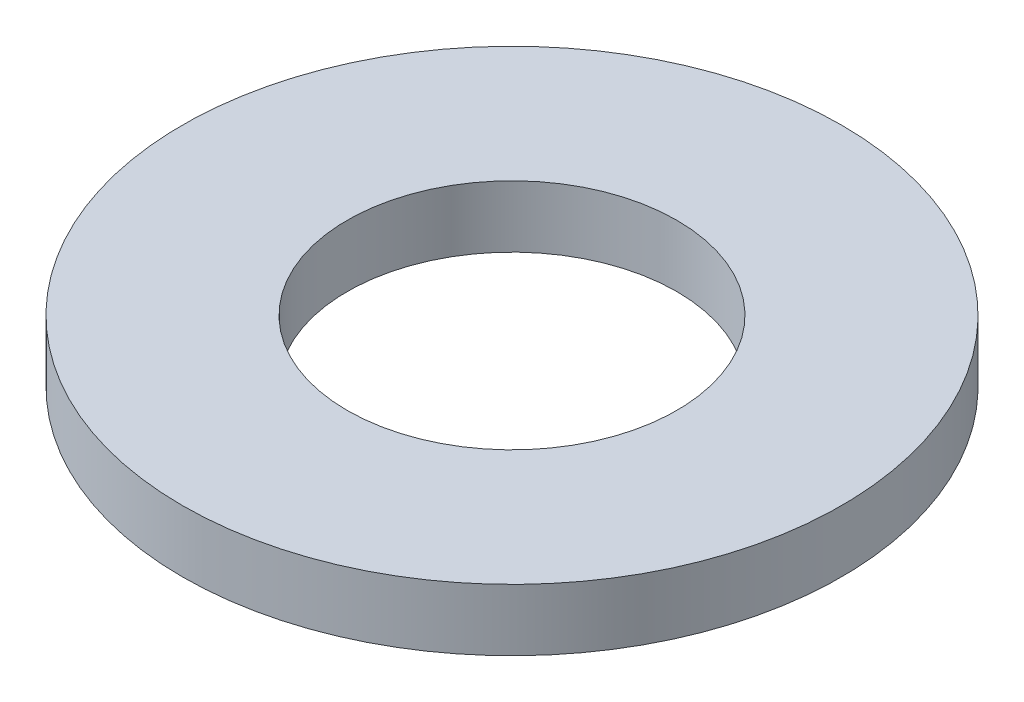
ISO-10303-21;
HEADER;
FILE_DESCRIPTION(('STEP AP214'),'2;1');
FILE_NAME('part.step','',(''),(''),'','','');
FILE_SCHEMA(('AUTOMOTIVE_DESIGN { 1 0 10303 214 1 1 1 1 }'));
ENDSEC;
DATA;
#1=APPLICATION_CONTEXT('core data for automotive mechanical design processes');
#2=APPLICATION_PROTOCOL_DEFINITION('international standard','automotive_design',2000,#1);
#3=PRODUCT_CONTEXT('',#1,'mechanical');
#4=PRODUCT('Part','Part','',(#3));
#5=PRODUCT_RELATED_PRODUCT_CATEGORY('part','',(#4));
#6=PRODUCT_DEFINITION_FORMATION('','',#4);
#7=PRODUCT_DEFINITION_CONTEXT('part definition',#1,'design');
#8=PRODUCT_DEFINITION('design','',#6,#7);
#9=PRODUCT_DEFINITION_SHAPE('','',#8);
#10=(LENGTH_UNIT() NAMED_UNIT(*) SI_UNIT(.MILLI.,.METRE.));
#11=(NAMED_UNIT(*) PLANE_ANGLE_UNIT() SI_UNIT($,.RADIAN.));
#12=(NAMED_UNIT(*) SI_UNIT($,.STERADIAN.) SOLID_ANGLE_UNIT());
#13=UNCERTAINTY_MEASURE_WITH_UNIT(LENGTH_MEASURE(1.E-05),#10,'distance_accuracy_value','');
#14=(GEOMETRIC_REPRESENTATION_CONTEXT(3) GLOBAL_UNCERTAINTY_ASSIGNED_CONTEXT((#13)) GLOBAL_UNIT_ASSIGNED_CONTEXT((#10,
#11,#12)) REPRESENTATION_CONTEXT('',''));
#15=CARTESIAN_POINT('',(0.,0.,0.));
#16=DIRECTION('',(0.,0.,1.));
#17=DIRECTION('',(1.,0.,0.));
#18=AXIS2_PLACEMENT_3D('',#15,#16,#17);
#19=CARTESIAN_POINT('',(-2.44598391648444,1.5,-0.726151475206319));
#20=DIRECTION('',(0.,1.,0.));
#21=DIRECTION('',(0.,0.,1.));
#22=AXIS2_PLACEMENT_3D('',#19,#20,#21);
#23=PLANE('',#22);
#24=CARTESIAN_POINT('',(-2.44598391648444,1.5,-0.726151475206319));
#25=DIRECTION('',(0.,1.,0.));
#26=DIRECTION('',(0.,0.,1.));
#27=AXIS2_PLACEMENT_3D('',#24,#25,#26);
#28=CIRCLE('',#27,8.);
#29=CARTESIAN_POINT('',(-2.44598391648444,1.5,7.27384852479368));
#30=VERTEX_POINT('',#29);
#31=EDGE_CURVE('E10',#30,#30,#28,.T.);
#32=ORIENTED_EDGE('',*,*,#31,.T.);
#33=EDGE_LOOP('',(#32));
#34=FACE_BOUND('',#33,.T.);
#35=CARTESIAN_POINT('',(-2.44598391648444,1.5,-0.726151475206319));
#36=DIRECTION('',(0.,1.,0.));
#37=DIRECTION('',(0.,0.,1.));
#38=AXIS2_PLACEMENT_3D('',#35,#36,#37);
#39=CIRCLE('',#38,4.);
#40=CARTESIAN_POINT('',(-2.44598391648444,1.5,3.27384852479368));
#41=VERTEX_POINT('',#40);
#42=EDGE_CURVE('E47',#41,#41,#39,.T.);
#43=ORIENTED_EDGE('',*,*,#42,.F.);
#44=EDGE_LOOP('',(#43));
#45=FACE_BOUND('',#44,.T.);
#46=ADVANCED_FACE('F36',(#34,#45),#23,.T.);
#47=CARTESIAN_POINT('',(-2.44598391648444,0.,-0.726151475206319));
#48=DIRECTION('',(0.,1.,0.));
#49=DIRECTION('',(0.,0.,1.));
#50=AXIS2_PLACEMENT_3D('',#47,#48,#49);
#51=PLANE('',#50);
#52=CARTESIAN_POINT('',(-2.44598391648444,0.,-0.726151475206319));
#53=DIRECTION('',(0.,1.,0.));
#54=DIRECTION('',(0.,0.,1.));
#55=AXIS2_PLACEMENT_3D('',#52,#53,#54);
#56=CIRCLE('',#55,8.);
#57=CARTESIAN_POINT('',(-2.44598391648444,0.,7.27384852479368));
#58=VERTEX_POINT('',#57);
#59=EDGE_CURVE('E40',#58,#58,#56,.T.);
#60=ORIENTED_EDGE('',*,*,#59,.F.);
#61=EDGE_LOOP('',(#60));
#62=FACE_BOUND('',#61,.T.);
#63=CARTESIAN_POINT('',(-2.44598391648444,0.,-0.726151475206319));
#64=DIRECTION('',(0.,1.,0.));
#65=DIRECTION('',(0.,0.,1.));
#66=AXIS2_PLACEMENT_3D('',#63,#64,#65);
#67=CIRCLE('',#66,4.);
#68=CARTESIAN_POINT('',(-2.44598391648444,0.,3.27384852479368));
#69=VERTEX_POINT('',#68);
#70=EDGE_CURVE('E49',#69,#69,#67,.T.);
#71=ORIENTED_EDGE('',*,*,#70,.T.);
#72=EDGE_LOOP('',(#71));
#73=FACE_BOUND('',#72,.T.);
#74=ADVANCED_FACE('F59',(#62,#73),#51,.F.);
#75=CARTESIAN_POINT('',(-2.44598391648444,1.5,-0.726151475206319));
#76=DIRECTION('',(0.,-1.,0.));
#77=DIRECTION('',(0.,0.,-1.));
#78=AXIS2_PLACEMENT_3D('',#75,#76,#77);
#79=CYLINDRICAL_SURFACE('',#78,8.);
#80=ORIENTED_EDGE('',*,*,#31,.F.);
#81=EDGE_LOOP('',(#80));
#82=FACE_BOUND('',#81,.T.);
#83=ORIENTED_EDGE('',*,*,#59,.T.);
#84=EDGE_LOOP('',(#83));
#85=FACE_BOUND('',#84,.T.);
#86=ADVANCED_FACE('F38',(#82,#85),#79,.T.);
#87=CARTESIAN_POINT('',(-2.44598391648444,1.5,-0.726151475206319));
#88=DIRECTION('',(0.,-1.,0.));
#89=DIRECTION('',(0.,0.,-1.));
#90=AXIS2_PLACEMENT_3D('',#87,#88,#89);
#91=CYLINDRICAL_SURFACE('',#90,4.);
#92=ORIENTED_EDGE('',*,*,#42,.T.);
#93=EDGE_LOOP('',(#92));
#94=FACE_BOUND('',#93,.T.);
#95=ORIENTED_EDGE('',*,*,#70,.F.);
#96=EDGE_LOOP('',(#95));
#97=FACE_BOUND('',#96,.T.);
#98=ADVANCED_FACE('F55',(#94,#97),#91,.F.);
#99=CLOSED_SHELL('',(#46,#74,#86,#98));
#100=MANIFOLD_SOLID_BREP('B2',#99);
#101=ADVANCED_BREP_SHAPE_REPRESENTATION('',(#18,#100),#14);
#102=SHAPE_DEFINITION_REPRESENTATION(#9,#101);
ENDSEC;
END-ISO-10303-21;
